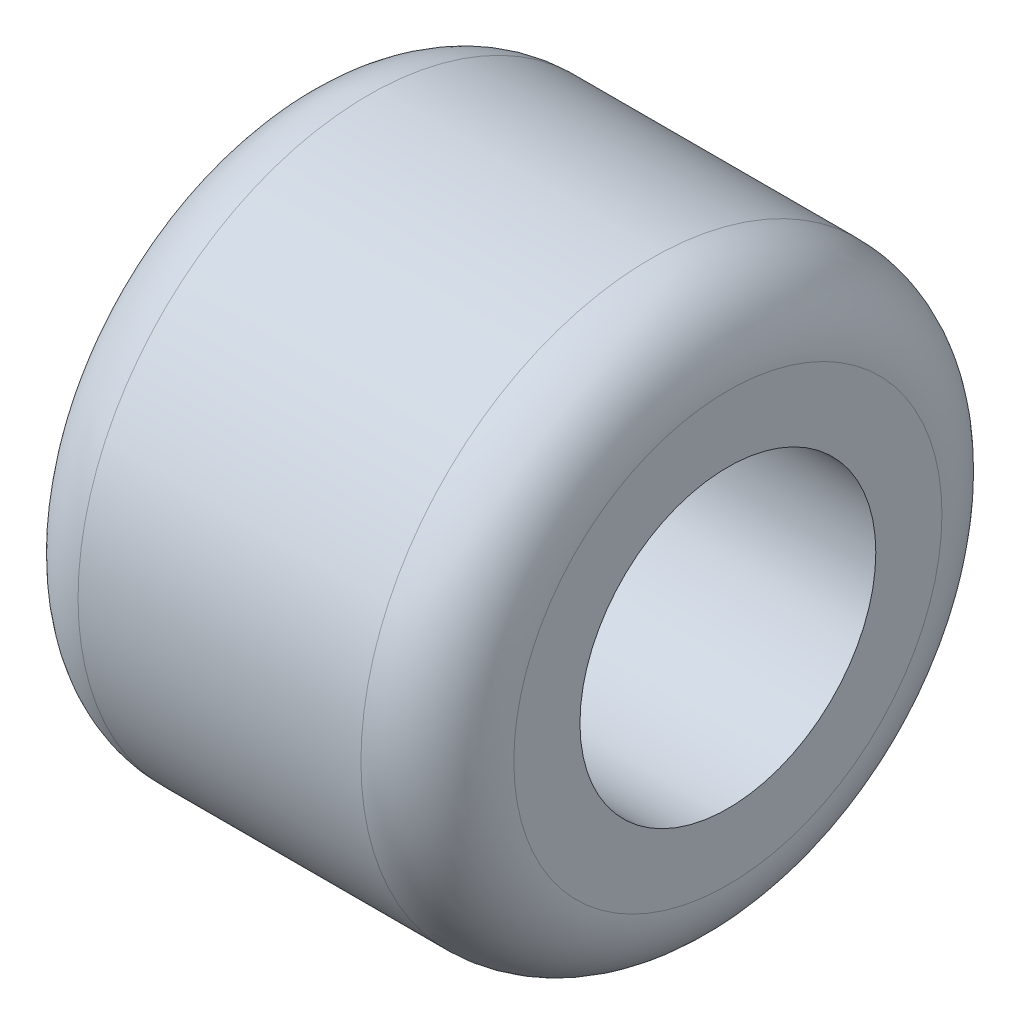
ISO-10303-21;
HEADER;
FILE_DESCRIPTION(('STEP AP214'),'2;1');
FILE_NAME('part.step','',(''),(''),'','','');
FILE_SCHEMA(('AUTOMOTIVE_DESIGN { 1 0 10303 214 1 1 1 1 }'));
ENDSEC;
DATA;
#1=APPLICATION_CONTEXT('core data for automotive mechanical design processes');
#2=APPLICATION_PROTOCOL_DEFINITION('international standard','automotive_design',2000,#1);
#3=PRODUCT_CONTEXT('',#1,'mechanical');
#4=PRODUCT('Part','Part','',(#3));
#5=PRODUCT_RELATED_PRODUCT_CATEGORY('part','',(#4));
#6=PRODUCT_DEFINITION_FORMATION('','',#4);
#7=PRODUCT_DEFINITION_CONTEXT('part definition',#1,'design');
#8=PRODUCT_DEFINITION('design','',#6,#7);
#9=PRODUCT_DEFINITION_SHAPE('','',#8);
#10=(LENGTH_UNIT() NAMED_UNIT(*) SI_UNIT(.MILLI.,.METRE.));
#11=(NAMED_UNIT(*) PLANE_ANGLE_UNIT() SI_UNIT($,.RADIAN.));
#12=(NAMED_UNIT(*) SI_UNIT($,.STERADIAN.) SOLID_ANGLE_UNIT());
#13=UNCERTAINTY_MEASURE_WITH_UNIT(LENGTH_MEASURE(1.E-05),#10,'distance_accuracy_value','');
#14=(GEOMETRIC_REPRESENTATION_CONTEXT(3) GLOBAL_UNCERTAINTY_ASSIGNED_CONTEXT((#13)) GLOBAL_UNIT_ASSIGNED_CONTEXT((#10,
#11,#12)) REPRESENTATION_CONTEXT('',''));
#15=CARTESIAN_POINT('',(0.,0.,0.));
#16=DIRECTION('',(0.,0.,1.));
#17=DIRECTION('',(1.,0.,0.));
#18=AXIS2_PLACEMENT_3D('',#15,#16,#17);
#19=CARTESIAN_POINT('',(-1.8034,0.,0.));
#20=DIRECTION('',(-1.,0.,0.));
#21=DIRECTION('',(0.,0.,1.));
#22=AXIS2_PLACEMENT_3D('',#19,#20,#21);
#23=CYLINDRICAL_SURFACE('',#22,2.45745);
#24=CARTESIAN_POINT('',(0.474040509881395,0.,0.));
#25=DIRECTION('',(-1.,0.,0.));
#26=DIRECTION('',(0.,0.,1.));
#27=AXIS2_PLACEMENT_3D('',#24,#25,#26);
#28=CIRCLE('',#27,2.45745);
#29=CARTESIAN_POINT('',(0.474040509881395,0.,2.45745));
#30=VERTEX_POINT('',#29);
#31=EDGE_CURVE('E64',#30,#30,#28,.T.);
#32=ORIENTED_EDGE('',*,*,#31,.T.);
#33=EDGE_LOOP('',(#32));
#34=FACE_BOUND('',#33,.T.);
#35=CARTESIAN_POINT('',(5.43559999999816,0.,0.));
#36=DIRECTION('',(1.,0.,0.));
#37=DIRECTION('',(0.,0.,-1.));
#38=AXIS2_PLACEMENT_3D('',#35,#36,#37);
#39=CIRCLE('',#38,2.45745);
#40=CARTESIAN_POINT('',(5.43559999999816,0.,-2.45745));
#41=VERTEX_POINT('',#40);
#42=EDGE_CURVE('E44',#41,#41,#39,.F.);
#43=ORIENTED_EDGE('',*,*,#42,.F.);
#44=EDGE_LOOP('',(#43));
#45=FACE_BOUND('',#44,.T.);
#46=ADVANCED_FACE('F40',(#34,#45),#23,.F.);
#47=CARTESIAN_POINT('',(4.16559999999816,0.,0.));
#48=DIRECTION('',(1.,0.,0.));
#49=DIRECTION('',(0.,0.,1.));
#50=AXIS2_PLACEMENT_3D('',#47,#48,#49);
#51=TOROIDAL_SURFACE('',#50,3.556,1.27);
#52=CARTESIAN_POINT('',(5.43559999999816,0.,0.));
#53=DIRECTION('',(1.,0.,0.));
#54=DIRECTION('',(0.,0.,-1.));
#55=AXIS2_PLACEMENT_3D('',#52,#53,#54);
#56=CIRCLE('',#55,3.556);
#57=CARTESIAN_POINT('',(5.43559999999816,0.,-3.556));
#58=VERTEX_POINT('',#57);
#59=EDGE_CURVE('E57',#58,#58,#56,.T.);
#60=ORIENTED_EDGE('',*,*,#59,.F.);
#61=EDGE_LOOP('',(#60));
#62=FACE_BOUND('',#61,.T.);
#63=CARTESIAN_POINT('',(4.16559999999816,0.,0.));
#64=DIRECTION('',(-1.,0.,0.));
#65=DIRECTION('',(0.,0.,-1.));
#66=AXIS2_PLACEMENT_3D('',#63,#64,#65);
#67=CIRCLE('',#66,4.826);
#68=CARTESIAN_POINT('',(4.16559999999816,0.,-4.826));
#69=VERTEX_POINT('',#68);
#70=EDGE_CURVE('E10',#69,#69,#67,.T.);
#71=ORIENTED_EDGE('',*,*,#70,.F.);
#72=EDGE_LOOP('',(#71));
#73=FACE_BOUND('',#72,.T.);
#74=ADVANCED_FACE('F81',(#62,#73),#51,.T.);
#75=CARTESIAN_POINT('',(-0.533463501587579,0.,0.));
#76=DIRECTION('',(-1.,0.,0.));
#77=DIRECTION('',(0.,0.,-1.));
#78=AXIS2_PLACEMENT_3D('',#75,#76,#77);
#79=TOROIDAL_SURFACE('',#78,3.556,1.27);
#80=CARTESIAN_POINT('',(-1.61825465199396,0.,0.));
#81=DIRECTION('',(1.,0.,0.));
#82=DIRECTION('',(0.,0.,-1.));
#83=AXIS2_PLACEMENT_3D('',#80,#81,#82);
#84=CIRCLE('',#83,4.2164);
#85=CARTESIAN_POINT('',(-1.61825465199396,0.,-4.2164));
#86=VERTEX_POINT('',#85);
#87=EDGE_CURVE('E62',#86,#86,#84,.F.);
#88=ORIENTED_EDGE('',*,*,#87,.F.);
#89=EDGE_LOOP('',(#88));
#90=FACE_BOUND('',#89,.T.);
#91=CARTESIAN_POINT('',(-0.533463501587579,0.,0.));
#92=DIRECTION('',(1.,0.,0.));
#93=DIRECTION('',(0.,0.,1.));
#94=AXIS2_PLACEMENT_3D('',#91,#92,#93);
#95=CIRCLE('',#94,4.826);
#96=CARTESIAN_POINT('',(-0.533463501587579,0.,4.826));
#97=VERTEX_POINT('',#96);
#98=EDGE_CURVE('E49',#97,#97,#95,.T.);
#99=ORIENTED_EDGE('',*,*,#98,.F.);
#100=EDGE_LOOP('',(#99));
#101=FACE_BOUND('',#100,.T.);
#102=ADVANCED_FACE('F86',(#90,#101),#79,.T.);
#103=CARTESIAN_POINT('',(-1.83967424627341E-12,0.,0.));
#104=DIRECTION('',(-1.,0.,0.));
#105=DIRECTION('',(0.,0.,-1.));
#106=AXIS2_PLACEMENT_3D('',#103,#104,#105);
#107=CYLINDRICAL_SURFACE('',#106,4.826);
#108=ORIENTED_EDGE('',*,*,#98,.T.);
#109=EDGE_LOOP('',(#108));
#110=FACE_BOUND('',#109,.T.);
#111=ORIENTED_EDGE('',*,*,#70,.T.);
#112=EDGE_LOOP('',(#111));
#113=FACE_BOUND('',#112,.T.);
#114=ADVANCED_FACE('F42',(#110,#113),#107,.T.);
#115=CARTESIAN_POINT('',(5.43559999999816,-4.7498,-4.7498));
#116=DIRECTION('',(1.,0.,0.));
#117=DIRECTION('',(0.,-1.,0.));
#118=AXIS2_PLACEMENT_3D('',#115,#116,#117);
#119=PLANE('',#118);
#120=ORIENTED_EDGE('',*,*,#59,.T.);
#121=EDGE_LOOP('',(#120));
#122=FACE_BOUND('',#121,.T.);
#123=ORIENTED_EDGE('',*,*,#42,.T.);
#124=EDGE_LOOP('',(#123));
#125=FACE_BOUND('',#124,.T.);
#126=ADVANCED_FACE('F78',(#122,#125),#119,.T.);
#127=CARTESIAN_POINT('',(-1.5494,0.,0.));
#128=DIRECTION('',(-1.,0.,0.));
#129=DIRECTION('',(0.,0.,1.));
#130=AXIS2_PLACEMENT_3D('',#127,#128,#129);
#131=CONICAL_SURFACE('',#130,4.2164,0.715584993317675);
#132=ORIENTED_EDGE('',*,*,#31,.F.);
#133=EDGE_LOOP('',(#132));
#134=FACE_BOUND('',#133,.T.);
#135=CARTESIAN_POINT('',(-1.5494,0.,0.));
#136=DIRECTION('',(-1.,0.,0.));
#137=DIRECTION('',(0.,0.,1.));
#138=AXIS2_PLACEMENT_3D('',#135,#136,#137);
#139=CIRCLE('',#138,4.2164);
#140=CARTESIAN_POINT('',(-1.5494,0.,4.2164));
#141=VERTEX_POINT('',#140);
#142=EDGE_CURVE('E68',#141,#141,#139,.T.);
#143=ORIENTED_EDGE('',*,*,#142,.T.);
#144=EDGE_LOOP('',(#143));
#145=FACE_BOUND('',#144,.T.);
#146=ADVANCED_FACE('F91',(#134,#145),#131,.F.);
#147=CARTESIAN_POINT('',(-1.8034,0.,0.));
#148=DIRECTION('',(-1.,0.,0.));
#149=DIRECTION('',(0.,0.,1.));
#150=AXIS2_PLACEMENT_3D('',#147,#148,#149);
#151=CYLINDRICAL_SURFACE('',#150,4.2164);
#152=ORIENTED_EDGE('',*,*,#87,.T.);
#153=EDGE_LOOP('',(#152));
#154=FACE_BOUND('',#153,.T.);
#155=ORIENTED_EDGE('',*,*,#142,.F.);
#156=EDGE_LOOP('',(#155));
#157=FACE_BOUND('',#156,.T.);
#158=ADVANCED_FACE('F101',(#154,#157),#151,.F.);
#159=CLOSED_SHELL('',(#46,#74,#102,#114,#126,#146,#158));
#160=MANIFOLD_SOLID_BREP('B2',#159);
#161=ADVANCED_BREP_SHAPE_REPRESENTATION('',(#18,#160),#14);
#162=SHAPE_DEFINITION_REPRESENTATION(#9,#161);
ENDSEC;
END-ISO-10303-21;
